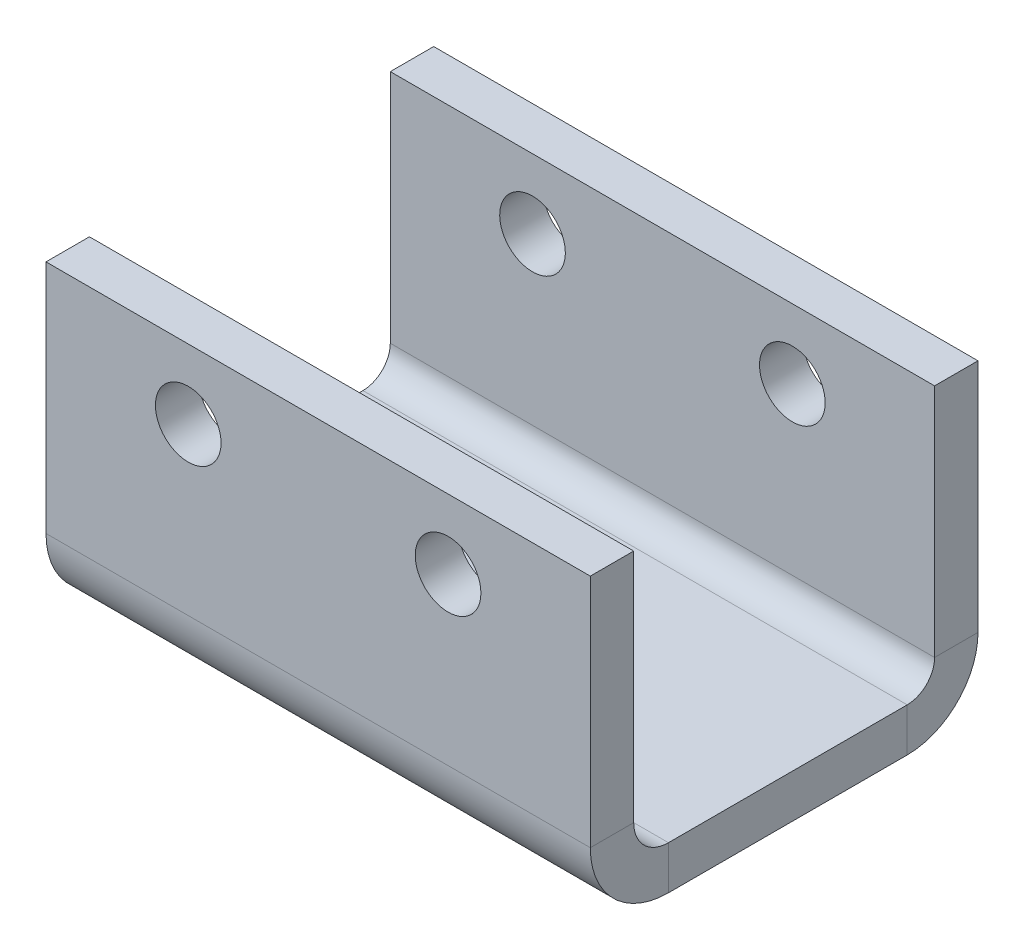
ISO-10303-21;
HEADER;
FILE_DESCRIPTION(('STEP AP214'),'2;1');
FILE_NAME('part.step','',(''),(''),'','','');
FILE_SCHEMA(('AUTOMOTIVE_DESIGN { 1 0 10303 214 1 1 1 1 }'));
ENDSEC;
DATA;
#1=APPLICATION_CONTEXT('core data for automotive mechanical design processes');
#2=APPLICATION_PROTOCOL_DEFINITION('international standard','automotive_design',2000,#1);
#3=PRODUCT_CONTEXT('',#1,'mechanical');
#4=PRODUCT('Part','Part','',(#3));
#5=PRODUCT_RELATED_PRODUCT_CATEGORY('part','',(#4));
#6=PRODUCT_DEFINITION_FORMATION('','',#4);
#7=PRODUCT_DEFINITION_CONTEXT('part definition',#1,'design');
#8=PRODUCT_DEFINITION('design','',#6,#7);
#9=PRODUCT_DEFINITION_SHAPE('','',#8);
#10=(LENGTH_UNIT() NAMED_UNIT(*) SI_UNIT(.MILLI.,.METRE.));
#11=(NAMED_UNIT(*) PLANE_ANGLE_UNIT() SI_UNIT($,.RADIAN.));
#12=(NAMED_UNIT(*) SI_UNIT($,.STERADIAN.) SOLID_ANGLE_UNIT());
#13=UNCERTAINTY_MEASURE_WITH_UNIT(LENGTH_MEASURE(1.E-05),#10,'distance_accuracy_value','');
#14=(GEOMETRIC_REPRESENTATION_CONTEXT(3) GLOBAL_UNCERTAINTY_ASSIGNED_CONTEXT((#13)) GLOBAL_UNIT_ASSIGNED_CONTEXT((#10,
#11,#12)) REPRESENTATION_CONTEXT('',''));
#15=CARTESIAN_POINT('',(0.,0.,0.));
#16=DIRECTION('',(0.,0.,1.));
#17=DIRECTION('',(1.,0.,0.));
#18=AXIS2_PLACEMENT_3D('',#15,#16,#17);
#19=CARTESIAN_POINT('',(9.95,2.54,0.79375));
#20=DIRECTION('',(1.,0.,0.));
#21=DIRECTION('',(0.,1.,0.));
#22=AXIS2_PLACEMENT_3D('',#19,#20,#21);
#23=PLANE('',#22);
#24=DIRECTION('',(0.,0.,1.));
#25=VECTOR('',#24,1.);
#26=CARTESIAN_POINT('',(9.95,-6.06,0.79375));
#27=LINE('',#26,#25);
#28=CARTESIAN_POINT('',(9.95,-6.06,-0.793749999999999));
#29=VERTEX_POINT('',#28);
#30=CARTESIAN_POINT('',(9.95,-6.06,0.79375));
#31=VERTEX_POINT('',#30);
#32=EDGE_CURVE('E13',#29,#31,#27,.T.);
#33=ORIENTED_EDGE('',*,*,#32,.F.);
#34=DIRECTION('',(0.,1.,0.));
#35=VECTOR('',#34,1.);
#36=CARTESIAN_POINT('',(9.95,0.,-0.79375));
#37=LINE('',#36,#35);
#38=CARTESIAN_POINT('',(9.95,2.54,-0.79375));
#39=VERTEX_POINT('',#38);
#40=EDGE_CURVE('E225',#29,#39,#37,.T.);
#41=ORIENTED_EDGE('',*,*,#40,.T.);
#42=DIRECTION('',(0.,0.,1.));
#43=VECTOR('',#42,1.);
#44=CARTESIAN_POINT('',(9.95,2.54,0.79375));
#45=LINE('',#44,#43);
#46=CARTESIAN_POINT('',(9.95,2.54,0.79375));
#47=VERTEX_POINT('',#46);
#48=EDGE_CURVE('E97',#39,#47,#45,.T.);
#49=ORIENTED_EDGE('',*,*,#48,.T.);
#50=DIRECTION('',(0.,1.,0.));
#51=VECTOR('',#50,1.);
#52=CARTESIAN_POINT('',(9.95,2.54,0.79375));
#53=LINE('',#52,#51);
#54=EDGE_CURVE('E209',#31,#47,#53,.T.);
#55=ORIENTED_EDGE('',*,*,#54,.F.);
#56=EDGE_LOOP('',(#33,#41,#49,#55));
#57=FACE_BOUND('',#56,.T.);
#58=ADVANCED_FACE('F87',(#57),#23,.T.);
#59=CARTESIAN_POINT('',(-9.94999999999999,2.54,0.79375));
#60=DIRECTION('',(0.,1.,0.));
#61=DIRECTION('',(-1.,0.,0.));
#62=AXIS2_PLACEMENT_3D('',#59,#60,#61);
#63=PLANE('',#62);
#64=ORIENTED_EDGE('',*,*,#48,.F.);
#65=DIRECTION('',(1.,0.,0.));
#66=VECTOR('',#65,1.);
#67=CARTESIAN_POINT('',(0.,2.54,-0.79375));
#68=LINE('',#67,#66);
#69=CARTESIAN_POINT('',(-9.94999999999999,2.54,-0.79375));
#70=VERTEX_POINT('',#69);
#71=EDGE_CURVE('E223',#39,#70,#68,.F.);
#72=ORIENTED_EDGE('',*,*,#71,.T.);
#73=DIRECTION('',(0.,0.,1.));
#74=VECTOR('',#73,1.);
#75=CARTESIAN_POINT('',(-9.94999999999999,2.54,0.79375));
#76=LINE('',#75,#74);
#77=CARTESIAN_POINT('',(-9.94999999999999,2.54,0.79375));
#78=VERTEX_POINT('',#77);
#79=EDGE_CURVE('E105',#70,#78,#76,.T.);
#80=ORIENTED_EDGE('',*,*,#79,.T.);
#81=DIRECTION('',(-1.,0.,0.));
#82=VECTOR('',#81,1.);
#83=CARTESIAN_POINT('',(-9.94999999999999,2.54,0.79375));
#84=LINE('',#83,#82);
#85=EDGE_CURVE('E212',#47,#78,#84,.T.);
#86=ORIENTED_EDGE('',*,*,#85,.F.);
#87=EDGE_LOOP('',(#64,#72,#80,#86));
#88=FACE_BOUND('',#87,.T.);
#89=ADVANCED_FACE('F239',(#88),#63,.T.);
#90=CARTESIAN_POINT('',(-9.94999999999999,2.54,0.79375));
#91=DIRECTION('',(-1.,0.,0.));
#92=DIRECTION('',(0.,-1.,0.));
#93=AXIS2_PLACEMENT_3D('',#90,#91,#92);
#94=PLANE('',#93);
#95=ORIENTED_EDGE('',*,*,#79,.F.);
#96=DIRECTION('',(0.,1.,0.));
#97=VECTOR('',#96,1.);
#98=CARTESIAN_POINT('',(-9.94999999999999,0.,-0.79375));
#99=LINE('',#98,#97);
#100=CARTESIAN_POINT('',(-9.94999999999999,-6.06,-0.793749999999999));
#101=VERTEX_POINT('',#100);
#102=EDGE_CURVE('E220',#70,#101,#99,.F.);
#103=ORIENTED_EDGE('',*,*,#102,.T.);
#104=DIRECTION('',(0.,0.,1.));
#105=VECTOR('',#104,1.);
#106=CARTESIAN_POINT('',(-9.94999999999999,-6.06,0.79375));
#107=LINE('',#106,#105);
#108=CARTESIAN_POINT('',(-9.94999999999999,-6.06,0.793750000000001));
#109=VERTEX_POINT('',#108);
#110=EDGE_CURVE('E91',#101,#109,#107,.T.);
#111=ORIENTED_EDGE('',*,*,#110,.T.);
#112=DIRECTION('',(0.,-1.,0.));
#113=VECTOR('',#112,1.);
#114=CARTESIAN_POINT('',(-9.94999999999999,2.54,0.79375));
#115=LINE('',#114,#113);
#116=EDGE_CURVE('E204',#78,#109,#115,.T.);
#117=ORIENTED_EDGE('',*,*,#116,.F.);
#118=EDGE_LOOP('',(#95,#103,#111,#117));
#119=FACE_BOUND('',#118,.T.);
#120=ADVANCED_FACE('F241',(#119),#94,.T.);
#121=CARTESIAN_POINT('',(-4.75,0.,0.79375));
#122=DIRECTION('',(0.,0.,1.));
#123=DIRECTION('',(1.,0.,0.));
#124=AXIS2_PLACEMENT_3D('',#121,#122,#123);
#125=CYLINDRICAL_SURFACE('',#124,1.2);
#126=CARTESIAN_POINT('',(-4.75,0.,0.79375));
#127=DIRECTION('',(0.,0.,1.));
#128=DIRECTION('',(1.,0.,0.));
#129=AXIS2_PLACEMENT_3D('',#126,#127,#128);
#130=CIRCLE('',#129,1.2);
#131=CARTESIAN_POINT('',(-3.55,0.,0.79375));
#132=VERTEX_POINT('',#131);
#133=EDGE_CURVE('E201',#132,#132,#130,.T.);
#134=ORIENTED_EDGE('',*,*,#133,.T.);
#135=EDGE_LOOP('',(#134));
#136=FACE_BOUND('',#135,.T.);
#137=CARTESIAN_POINT('',(-4.75,0.,-0.79375));
#138=DIRECTION('',(0.,0.,1.));
#139=DIRECTION('',(1.,0.,0.));
#140=AXIS2_PLACEMENT_3D('',#137,#138,#139);
#141=CIRCLE('',#140,1.2);
#142=CARTESIAN_POINT('',(-3.55,0.,-0.79375));
#143=VERTEX_POINT('',#142);
#144=EDGE_CURVE('E197',#143,#143,#141,.T.);
#145=ORIENTED_EDGE('',*,*,#144,.F.);
#146=EDGE_LOOP('',(#145));
#147=FACE_BOUND('',#146,.T.);
#148=ADVANCED_FACE('F247',(#136,#147),#125,.F.);
#149=CARTESIAN_POINT('',(4.75,0.,0.79375));
#150=DIRECTION('',(0.,0.,1.));
#151=DIRECTION('',(1.,0.,0.));
#152=AXIS2_PLACEMENT_3D('',#149,#150,#151);
#153=CYLINDRICAL_SURFACE('',#152,1.2);
#154=CARTESIAN_POINT('',(4.75,0.,0.79375));
#155=DIRECTION('',(0.,0.,1.));
#156=DIRECTION('',(1.,0.,0.));
#157=AXIS2_PLACEMENT_3D('',#154,#155,#156);
#158=CIRCLE('',#157,1.2);
#159=CARTESIAN_POINT('',(5.95,0.,0.79375));
#160=VERTEX_POINT('',#159);
#161=EDGE_CURVE('E215',#160,#160,#158,.T.);
#162=ORIENTED_EDGE('',*,*,#161,.T.);
#163=EDGE_LOOP('',(#162));
#164=FACE_BOUND('',#163,.T.);
#165=CARTESIAN_POINT('',(4.75,0.,-0.79375));
#166=DIRECTION('',(0.,0.,1.));
#167=DIRECTION('',(1.,0.,0.));
#168=AXIS2_PLACEMENT_3D('',#165,#166,#167);
#169=CIRCLE('',#168,1.2);
#170=CARTESIAN_POINT('',(5.95,0.,-0.79375));
#171=VERTEX_POINT('',#170);
#172=EDGE_CURVE('E205',#171,#171,#169,.T.);
#173=ORIENTED_EDGE('',*,*,#172,.F.);
#174=EDGE_LOOP('',(#173));
#175=FACE_BOUND('',#174,.T.);
#176=ADVANCED_FACE('F89',(#164,#175),#153,.F.);
#177=CARTESIAN_POINT('',(0.,0.,0.79375));
#178=DIRECTION('',(0.,0.,1.));
#179=DIRECTION('',(1.,0.,0.));
#180=AXIS2_PLACEMENT_3D('',#177,#178,#179);
#181=PLANE('',#180);
#182=ORIENTED_EDGE('',*,*,#133,.F.);
#183=EDGE_LOOP('',(#182));
#184=FACE_BOUND('',#183,.T.);
#185=ORIENTED_EDGE('',*,*,#116,.T.);
#186=DIRECTION('',(1.,0.,0.));
#187=VECTOR('',#186,1.);
#188=CARTESIAN_POINT('',(-9.94999999999999,-6.06,0.79375));
#189=LINE('',#188,#187);
#190=EDGE_CURVE('E125',#109,#31,#189,.T.);
#191=ORIENTED_EDGE('',*,*,#190,.T.);
#192=ORIENTED_EDGE('',*,*,#54,.T.);
#193=ORIENTED_EDGE('',*,*,#85,.T.);
#194=EDGE_LOOP('',(#185,#191,#192,#193));
#195=FACE_BOUND('',#194,.T.);
#196=ORIENTED_EDGE('',*,*,#161,.F.);
#197=EDGE_LOOP('',(#196));
#198=FACE_BOUND('',#197,.T.);
#199=ADVANCED_FACE('F237',(#184,#195,#198),#181,.T.);
#200=CARTESIAN_POINT('',(0.,0.,-0.79375));
#201=DIRECTION('',(0.,0.,1.));
#202=DIRECTION('',(1.,0.,0.));
#203=AXIS2_PLACEMENT_3D('',#200,#201,#202);
#204=PLANE('',#203);
#205=ORIENTED_EDGE('',*,*,#144,.T.);
#206=EDGE_LOOP('',(#205));
#207=FACE_BOUND('',#206,.T.);
#208=ORIENTED_EDGE('',*,*,#102,.F.);
#209=ORIENTED_EDGE('',*,*,#71,.F.);
#210=ORIENTED_EDGE('',*,*,#40,.F.);
#211=DIRECTION('',(1.,0.,0.));
#212=VECTOR('',#211,1.);
#213=CARTESIAN_POINT('',(0.,-6.06,-0.79375));
#214=LINE('',#213,#212);
#215=EDGE_CURVE('E222',#101,#29,#214,.T.);
#216=ORIENTED_EDGE('',*,*,#215,.F.);
#217=EDGE_LOOP('',(#208,#209,#210,#216));
#218=FACE_BOUND('',#217,.T.);
#219=ORIENTED_EDGE('',*,*,#172,.T.);
#220=EDGE_LOOP('',(#219));
#221=FACE_BOUND('',#220,.T.);
#222=ADVANCED_FACE('F253',(#207,#218,#221),#204,.F.);
#223=CARTESIAN_POINT('',(9.95,-6.06,-2.06375));
#224=DIRECTION('',(1.,0.,0.));
#225=DIRECTION('',(0.,0.,-1.));
#226=AXIS2_PLACEMENT_3D('',#223,#224,#225);
#227=PLANE('',#226);
#228=DIRECTION('',(0.,1.,0.));
#229=VECTOR('',#228,1.);
#230=CARTESIAN_POINT('',(9.95,-8.9175,-2.06374999999999));
#231=LINE('',#230,#229);
#232=CARTESIAN_POINT('',(9.95,-7.33,-2.06375));
#233=VERTEX_POINT('',#232);
#234=CARTESIAN_POINT('',(9.95,-8.9175,-2.06374999999999));
#235=VERTEX_POINT('',#234);
#236=EDGE_CURVE('E159',#233,#235,#231,.F.);
#237=ORIENTED_EDGE('',*,*,#236,.F.);
#238=CARTESIAN_POINT('',(9.95,-6.06,-2.06375));
#239=DIRECTION('',(-1.,0.,0.));
#240=DIRECTION('',(0.,0.,1.));
#241=AXIS2_PLACEMENT_3D('',#238,#239,#240);
#242=CIRCLE('',#241,1.27);
#243=EDGE_CURVE('E153',#29,#233,#242,.F.);
#244=ORIENTED_EDGE('',*,*,#243,.F.);
#245=ORIENTED_EDGE('',*,*,#32,.T.);
#246=CARTESIAN_POINT('',(9.95,-6.06,-2.06375));
#247=DIRECTION('',(-1.,0.,0.));
#248=DIRECTION('',(0.,0.,1.));
#249=AXIS2_PLACEMENT_3D('',#246,#247,#248);
#250=CIRCLE('',#249,2.8575);
#251=EDGE_CURVE('E194',#31,#235,#250,.F.);
#252=ORIENTED_EDGE('',*,*,#251,.T.);
#253=EDGE_LOOP('',(#237,#244,#245,#252));
#254=FACE_BOUND('',#253,.T.);
#255=ADVANCED_FACE('F256',(#254),#227,.T.);
#256=CARTESIAN_POINT('',(-9.94999999999999,-6.06,-2.06375));
#257=DIRECTION('',(1.,0.,0.));
#258=DIRECTION('',(0.,0.,-1.));
#259=AXIS2_PLACEMENT_3D('',#256,#257,#258);
#260=PLANE('',#259);
#261=CARTESIAN_POINT('',(-9.94999999999999,-6.06,-2.06375));
#262=DIRECTION('',(-1.,0.,0.));
#263=DIRECTION('',(0.,0.,1.));
#264=AXIS2_PLACEMENT_3D('',#261,#262,#263);
#265=CIRCLE('',#264,1.27);
#266=CARTESIAN_POINT('',(-9.94999999999999,-7.33,-2.06375));
#267=VERTEX_POINT('',#266);
#268=EDGE_CURVE('E150',#267,#101,#265,.T.);
#269=ORIENTED_EDGE('',*,*,#268,.F.);
#270=DIRECTION('',(0.,1.,0.));
#271=VECTOR('',#270,1.);
#272=CARTESIAN_POINT('',(-9.94999999999999,-7.33,-2.06375));
#273=LINE('',#272,#271);
#274=CARTESIAN_POINT('',(-9.94999999999999,-8.9175,-2.06374999999999));
#275=VERTEX_POINT('',#274);
#276=EDGE_CURVE('E158',#267,#275,#273,.F.);
#277=ORIENTED_EDGE('',*,*,#276,.T.);
#278=CARTESIAN_POINT('',(-9.94999999999999,-6.06,-2.06375));
#279=DIRECTION('',(-1.,0.,0.));
#280=DIRECTION('',(0.,0.,1.));
#281=AXIS2_PLACEMENT_3D('',#278,#279,#280);
#282=CIRCLE('',#281,2.8575);
#283=EDGE_CURVE('E198',#275,#109,#282,.T.);
#284=ORIENTED_EDGE('',*,*,#283,.T.);
#285=ORIENTED_EDGE('',*,*,#110,.F.);
#286=EDGE_LOOP('',(#269,#277,#284,#285));
#287=FACE_BOUND('',#286,.T.);
#288=ADVANCED_FACE('F164',(#287),#260,.F.);
#289=CARTESIAN_POINT('',(-9.94999999999999,-6.06,-2.06375));
#290=DIRECTION('',(-1.,0.,0.));
#291=DIRECTION('',(0.,-1.,0.));
#292=AXIS2_PLACEMENT_3D('',#289,#290,#291);
#293=CYLINDRICAL_SURFACE('',#292,2.8575);
#294=ORIENTED_EDGE('',*,*,#190,.F.);
#295=ORIENTED_EDGE('',*,*,#283,.F.);
#296=DIRECTION('',(-1.,0.,0.));
#297=VECTOR('',#296,1.);
#298=CARTESIAN_POINT('',(9.95,-8.9175,-2.06374999999999));
#299=LINE('',#298,#297);
#300=EDGE_CURVE('E180',#275,#235,#299,.F.);
#301=ORIENTED_EDGE('',*,*,#300,.T.);
#302=ORIENTED_EDGE('',*,*,#251,.F.);
#303=EDGE_LOOP('',(#294,#295,#301,#302));
#304=FACE_BOUND('',#303,.T.);
#305=ADVANCED_FACE('F263',(#304),#293,.T.);
#306=CARTESIAN_POINT('',(-9.94999999999999,-6.06,-2.06375));
#307=DIRECTION('',(-1.,0.,0.));
#308=DIRECTION('',(0.,-1.,0.));
#309=AXIS2_PLACEMENT_3D('',#306,#307,#308);
#310=CYLINDRICAL_SURFACE('',#309,1.27);
#311=ORIENTED_EDGE('',*,*,#215,.T.);
#312=ORIENTED_EDGE('',*,*,#243,.T.);
#313=DIRECTION('',(-1.,0.,0.));
#314=VECTOR('',#313,1.);
#315=CARTESIAN_POINT('',(9.95,-7.33,-2.06375));
#316=LINE('',#315,#314);
#317=EDGE_CURVE('E147',#233,#267,#316,.T.);
#318=ORIENTED_EDGE('',*,*,#317,.T.);
#319=ORIENTED_EDGE('',*,*,#268,.T.);
#320=EDGE_LOOP('',(#311,#312,#318,#319));
#321=FACE_BOUND('',#320,.T.);
#322=ADVANCED_FACE('F149',(#321),#310,.F.);
#323=CARTESIAN_POINT('',(-9.94999999999998,-8.91750000000003,-10.79375));
#324=DIRECTION('',(1.,0.,0.));
#325=DIRECTION('',(0.,0.,-1.));
#326=AXIS2_PLACEMENT_3D('',#323,#324,#325);
#327=PLANE('',#326);
#328=ORIENTED_EDGE('',*,*,#276,.F.);
#329=DIRECTION('',(0.,0.,1.));
#330=VECTOR('',#329,1.);
#331=CARTESIAN_POINT('',(-9.94999999999998,-7.33000000000003,-10.79375));
#332=LINE('',#331,#330);
#333=CARTESIAN_POINT('',(-9.94999999999998,-7.33000000000004,-10.79375));
#334=VERTEX_POINT('',#333);
#335=EDGE_CURVE('E176',#267,#334,#332,.F.);
#336=ORIENTED_EDGE('',*,*,#335,.T.);
#337=DIRECTION('',(0.,1.,0.));
#338=VECTOR('',#337,1.);
#339=CARTESIAN_POINT('',(-9.94999999999998,-8.91750000000003,-10.79375));
#340=LINE('',#339,#338);
#341=CARTESIAN_POINT('',(-9.94999999999998,-8.91750000000004,-10.79375));
#342=VERTEX_POINT('',#341);
#343=EDGE_CURVE('E168',#342,#334,#340,.T.);
#344=ORIENTED_EDGE('',*,*,#343,.F.);
#345=DIRECTION('',(0.,0.,-1.));
#346=VECTOR('',#345,1.);
#347=CARTESIAN_POINT('',(-9.94999999999999,-8.91749999999999,0.));
#348=LINE('',#347,#346);
#349=EDGE_CURVE('E179',#275,#342,#348,.T.);
#350=ORIENTED_EDGE('',*,*,#349,.F.);
#351=EDGE_LOOP('',(#328,#336,#344,#350));
#352=FACE_BOUND('',#351,.T.);
#353=ADVANCED_FACE('F173',(#352),#327,.F.);
#354=CARTESIAN_POINT('',(9.95,-8.9175,-0.793749999999994));
#355=DIRECTION('',(-1.,0.,0.));
#356=DIRECTION('',(0.,0.,1.));
#357=AXIS2_PLACEMENT_3D('',#354,#355,#356);
#358=PLANE('',#357);
#359=ORIENTED_EDGE('',*,*,#236,.T.);
#360=DIRECTION('',(0.,0.,1.));
#361=VECTOR('',#360,1.);
#362=CARTESIAN_POINT('',(9.95,-8.91749999999999,0.));
#363=LINE('',#362,#361);
#364=CARTESIAN_POINT('',(9.95,-8.91750000000003,-10.79375));
#365=VERTEX_POINT('',#364);
#366=EDGE_CURVE('E369',#365,#235,#363,.T.);
#367=ORIENTED_EDGE('',*,*,#366,.F.);
#368=DIRECTION('',(0.,1.,0.));
#369=VECTOR('',#368,1.);
#370=CARTESIAN_POINT('',(9.95,-8.91750000000003,-10.79375));
#371=LINE('',#370,#369);
#372=CARTESIAN_POINT('',(9.95,-7.33000000000004,-10.79375));
#373=VERTEX_POINT('',#372);
#374=EDGE_CURVE('E366',#365,#373,#371,.T.);
#375=ORIENTED_EDGE('',*,*,#374,.T.);
#376=DIRECTION('',(0.,0.,-1.));
#377=VECTOR('',#376,1.);
#378=CARTESIAN_POINT('',(9.95,-7.33,-0.79375));
#379=LINE('',#378,#377);
#380=EDGE_CURVE('E186',#373,#233,#379,.F.);
#381=ORIENTED_EDGE('',*,*,#380,.T.);
#382=EDGE_LOOP('',(#359,#367,#375,#381));
#383=FACE_BOUND('',#382,.T.);
#384=ADVANCED_FACE('F273',(#383),#358,.F.);
#385=CARTESIAN_POINT('',(0.,-8.91749999999999,0.));
#386=DIRECTION('',(0.,1.,0.));
#387=DIRECTION('',(0.,0.,1.));
#388=AXIS2_PLACEMENT_3D('',#385,#386,#387);
#389=PLANE('',#388);
#390=ORIENTED_EDGE('',*,*,#300,.F.);
#391=ORIENTED_EDGE('',*,*,#349,.T.);
#392=DIRECTION('',(1.,0.,0.));
#393=VECTOR('',#392,1.);
#394=CARTESIAN_POINT('',(0.,-8.91750000000003,-10.79375));
#395=LINE('',#394,#393);
#396=EDGE_CURVE('E372',#342,#365,#395,.T.);
#397=ORIENTED_EDGE('',*,*,#396,.T.);
#398=ORIENTED_EDGE('',*,*,#366,.T.);
#399=EDGE_LOOP('',(#390,#391,#397,#398));
#400=FACE_BOUND('',#399,.T.);
#401=ADVANCED_FACE('F276',(#400),#389,.F.);
#402=CARTESIAN_POINT('',(0.,-7.32999999999999,0.));
#403=DIRECTION('',(0.,1.,0.));
#404=DIRECTION('',(0.,0.,1.));
#405=AXIS2_PLACEMENT_3D('',#402,#403,#404);
#406=PLANE('',#405);
#407=ORIENTED_EDGE('',*,*,#335,.F.);
#408=ORIENTED_EDGE('',*,*,#317,.F.);
#409=ORIENTED_EDGE('',*,*,#380,.F.);
#410=DIRECTION('',(-1.,0.,0.));
#411=VECTOR('',#410,1.);
#412=CARTESIAN_POINT('',(9.95,-7.33000000000003,-10.79375));
#413=LINE('',#412,#411);
#414=EDGE_CURVE('E184',#334,#373,#413,.F.);
#415=ORIENTED_EDGE('',*,*,#414,.F.);
#416=EDGE_LOOP('',(#407,#408,#409,#415));
#417=FACE_BOUND('',#416,.T.);
#418=ADVANCED_FACE('F182',(#417),#406,.T.);
#419=CARTESIAN_POINT('',(9.95,-6.33000000000004,-10.79375));
#420=DIRECTION('',(1.,0.,0.));
#421=DIRECTION('',(0.,0.,-1.));
#422=AXIS2_PLACEMENT_3D('',#419,#420,#421);
#423=PLANE('',#422);
#424=DIRECTION('',(0.,0.,1.));
#425=VECTOR('',#424,1.);
#426=CARTESIAN_POINT('',(9.95,-6.33000000000003,-13.3812500000001));
#427=LINE('',#426,#425);
#428=CARTESIAN_POINT('',(9.95,-6.33000000000005,-11.79375));
#429=VERTEX_POINT('',#428);
#430=CARTESIAN_POINT('',(9.95,-6.33000000000006,-13.38125));
#431=VERTEX_POINT('',#430);
#432=EDGE_CURVE('E349',#429,#431,#427,.F.);
#433=ORIENTED_EDGE('',*,*,#432,.F.);
#434=CARTESIAN_POINT('',(9.95,-6.33000000000004,-10.79375));
#435=DIRECTION('',(-1.,0.,0.));
#436=DIRECTION('',(0.,0.,1.));
#437=AXIS2_PLACEMENT_3D('',#434,#435,#436);
#438=CIRCLE('',#437,1.);
#439=EDGE_CURVE('E357',#373,#429,#438,.F.);
#440=ORIENTED_EDGE('',*,*,#439,.F.);
#441=ORIENTED_EDGE('',*,*,#374,.F.);
#442=CARTESIAN_POINT('',(9.95,-6.33000000000004,-10.79375));
#443=DIRECTION('',(-1.,0.,0.));
#444=DIRECTION('',(0.,0.,1.));
#445=AXIS2_PLACEMENT_3D('',#442,#443,#444);
#446=CIRCLE('',#445,2.5875);
#447=EDGE_CURVE('E193',#365,#431,#446,.F.);
#448=ORIENTED_EDGE('',*,*,#447,.T.);
#449=EDGE_LOOP('',(#433,#440,#441,#448));
#450=FACE_BOUND('',#449,.T.);
#451=ADVANCED_FACE('F280',(#450),#423,.T.);
#452=CARTESIAN_POINT('',(-9.94999999999998,-6.33000000000004,-10.79375));
#453=DIRECTION('',(1.,0.,0.));
#454=DIRECTION('',(0.,0.,-1.));
#455=AXIS2_PLACEMENT_3D('',#452,#453,#454);
#456=PLANE('',#455);
#457=CARTESIAN_POINT('',(-9.94999999999998,-6.33000000000004,-10.79375));
#458=DIRECTION('',(-1.,0.,0.));
#459=DIRECTION('',(0.,0.,1.));
#460=AXIS2_PLACEMENT_3D('',#457,#458,#459);
#461=CIRCLE('',#460,1.);
#462=CARTESIAN_POINT('',(-9.94999999999998,-6.33000000000005,-11.79375));
#463=VERTEX_POINT('',#462);
#464=EDGE_CURVE('E360',#463,#334,#461,.T.);
#465=ORIENTED_EDGE('',*,*,#464,.F.);
#466=DIRECTION('',(0.,0.,1.));
#467=VECTOR('',#466,1.);
#468=CARTESIAN_POINT('',(-9.94999999999998,-6.33000000000004,-11.79375));
#469=LINE('',#468,#467);
#470=CARTESIAN_POINT('',(-9.94999999999998,-6.33000000000002,-13.38125));
#471=VERTEX_POINT('',#470);
#472=EDGE_CURVE('E340',#463,#471,#469,.F.);
#473=ORIENTED_EDGE('',*,*,#472,.T.);
#474=CARTESIAN_POINT('',(-9.94999999999998,-6.33000000000004,-10.79375));
#475=DIRECTION('',(-1.,0.,0.));
#476=DIRECTION('',(0.,0.,1.));
#477=AXIS2_PLACEMENT_3D('',#474,#475,#476);
#478=CIRCLE('',#477,2.5875);
#479=EDGE_CURVE('E354',#471,#342,#478,.T.);
#480=ORIENTED_EDGE('',*,*,#479,.T.);
#481=ORIENTED_EDGE('',*,*,#343,.T.);
#482=EDGE_LOOP('',(#465,#473,#480,#481));
#483=FACE_BOUND('',#482,.T.);
#484=ADVANCED_FACE('F284',(#483),#456,.F.);
#485=CARTESIAN_POINT('',(-9.94999999999998,-6.33000000000004,-10.79375));
#486=DIRECTION('',(-1.,0.,0.));
#487=DIRECTION('',(0.,0.,-1.));
#488=AXIS2_PLACEMENT_3D('',#485,#486,#487);
#489=CYLINDRICAL_SURFACE('',#488,2.5875);
#490=ORIENTED_EDGE('',*,*,#396,.F.);
#491=ORIENTED_EDGE('',*,*,#479,.F.);
#492=DIRECTION('',(-1.,0.,0.));
#493=VECTOR('',#492,1.);
#494=CARTESIAN_POINT('',(0.,-6.33000000000002,-13.38125));
#495=LINE('',#494,#493);
#496=EDGE_CURVE('E335',#431,#471,#495,.T.);
#497=ORIENTED_EDGE('',*,*,#496,.F.);
#498=ORIENTED_EDGE('',*,*,#447,.F.);
#499=EDGE_LOOP('',(#490,#491,#497,#498));
#500=FACE_BOUND('',#499,.T.);
#501=ADVANCED_FACE('F287',(#500),#489,.T.);
#502=CARTESIAN_POINT('',(-9.94999999999998,-6.33000000000004,-10.79375));
#503=DIRECTION('',(-1.,0.,0.));
#504=DIRECTION('',(0.,0.,-1.));
#505=AXIS2_PLACEMENT_3D('',#502,#503,#504);
#506=CYLINDRICAL_SURFACE('',#505,1.);
#507=ORIENTED_EDGE('',*,*,#414,.T.);
#508=ORIENTED_EDGE('',*,*,#439,.T.);
#509=DIRECTION('',(1.,0.,0.));
#510=VECTOR('',#509,1.);
#511=CARTESIAN_POINT('',(9.95,-6.33000000000004,-11.79375));
#512=LINE('',#511,#510);
#513=EDGE_CURVE('E346',#429,#463,#512,.F.);
#514=ORIENTED_EDGE('',*,*,#513,.T.);
#515=ORIENTED_EDGE('',*,*,#464,.T.);
#516=EDGE_LOOP('',(#507,#508,#514,#515));
#517=FACE_BOUND('',#516,.T.);
#518=ADVANCED_FACE('F292',(#517),#506,.F.);
#519=CARTESIAN_POINT('',(0.,0.,-13.38125));
#520=DIRECTION('',(0.,0.,-1.));
#521=DIRECTION('',(0.,1.,0.));
#522=AXIS2_PLACEMENT_3D('',#519,#520,#521);
#523=PLANE('',#522);
#524=CARTESIAN_POINT('',(4.75000000000001,-0.270000000000044,-13.38125));
#525=DIRECTION('',(0.,0.,-1.));
#526=DIRECTION('',(0.,1.,0.));
#527=AXIS2_PLACEMENT_3D('',#524,#525,#526);
#528=CIRCLE('',#527,1.2);
#529=CARTESIAN_POINT('',(4.75000000000001,0.929999999999955,-13.3812500000001));
#530=VERTEX_POINT('',#529);
#531=EDGE_CURVE('E705',#530,#530,#528,.T.);
#532=ORIENTED_EDGE('',*,*,#531,.F.);
#533=EDGE_LOOP('',(#532));
#534=FACE_BOUND('',#533,.T.);
#535=CARTESIAN_POINT('',(-4.74999999999999,-0.270000000000043,-13.38125));
#536=DIRECTION('',(0.,0.,-1.));
#537=DIRECTION('',(0.,1.,0.));
#538=AXIS2_PLACEMENT_3D('',#535,#536,#537);
#539=CIRCLE('',#538,1.2);
#540=CARTESIAN_POINT('',(-4.74999999999999,0.929999999999957,-13.3812500000001));
#541=VERTEX_POINT('',#540);
#542=EDGE_CURVE('E331',#541,#541,#539,.T.);
#543=ORIENTED_EDGE('',*,*,#542,.F.);
#544=EDGE_LOOP('',(#543));
#545=FACE_BOUND('',#544,.T.);
#546=DIRECTION('',(0.,1.,0.));
#547=VECTOR('',#546,1.);
#548=CARTESIAN_POINT('',(9.95,0.,-13.38125));
#549=LINE('',#548,#547);
#550=CARTESIAN_POINT('',(9.95,2.26999999999995,-13.3812500000001));
#551=VERTEX_POINT('',#550);
#552=EDGE_CURVE('E689',#551,#431,#549,.F.);
#553=ORIENTED_EDGE('',*,*,#552,.T.);
#554=ORIENTED_EDGE('',*,*,#496,.T.);
#555=DIRECTION('',(0.,-1.,0.));
#556=VECTOR('',#555,1.);
#557=CARTESIAN_POINT('',(-9.94999999999998,0.,-13.38125));
#558=LINE('',#557,#556);
#559=CARTESIAN_POINT('',(-9.94999999999998,2.26999999999996,-13.3812500000001));
#560=VERTEX_POINT('',#559);
#561=EDGE_CURVE('E686',#471,#560,#558,.F.);
#562=ORIENTED_EDGE('',*,*,#561,.T.);
#563=DIRECTION('',(-1.,0.,0.));
#564=VECTOR('',#563,1.);
#565=CARTESIAN_POINT('',(0.,2.26999999999996,-13.3812500000001));
#566=LINE('',#565,#564);
#567=EDGE_CURVE('E692',#560,#551,#566,.F.);
#568=ORIENTED_EDGE('',*,*,#567,.T.);
#569=EDGE_LOOP('',(#553,#554,#562,#568));
#570=FACE_BOUND('',#569,.T.);
#571=ADVANCED_FACE('F295',(#534,#545,#570),#523,.T.);
#572=CARTESIAN_POINT('',(0.,0.,-11.7937500000001));
#573=DIRECTION('',(0.,0.,-1.));
#574=DIRECTION('',(0.,1.,0.));
#575=AXIS2_PLACEMENT_3D('',#572,#573,#574);
#576=PLANE('',#575);
#577=CARTESIAN_POINT('',(-4.74999999999999,-0.270000000000031,-11.79375));
#578=DIRECTION('',(0.,0.,-1.));
#579=DIRECTION('',(0.,1.,0.));
#580=AXIS2_PLACEMENT_3D('',#577,#578,#579);
#581=CIRCLE('',#580,1.2);
#582=CARTESIAN_POINT('',(-4.74999999999999,0.929999999999968,-11.7937500000001));
#583=VERTEX_POINT('',#582);
#584=EDGE_CURVE('E334',#583,#583,#581,.T.);
#585=ORIENTED_EDGE('',*,*,#584,.T.);
#586=EDGE_LOOP('',(#585));
#587=FACE_BOUND('',#586,.T.);
#588=CARTESIAN_POINT('',(4.75000000000001,-0.270000000000033,-11.79375));
#589=DIRECTION('',(0.,0.,-1.));
#590=DIRECTION('',(0.,1.,0.));
#591=AXIS2_PLACEMENT_3D('',#588,#589,#590);
#592=CIRCLE('',#591,1.2);
#593=CARTESIAN_POINT('',(4.75000000000001,0.929999999999966,-11.7937500000001));
#594=VERTEX_POINT('',#593);
#595=EDGE_CURVE('E337',#594,#594,#592,.T.);
#596=ORIENTED_EDGE('',*,*,#595,.T.);
#597=EDGE_LOOP('',(#596));
#598=FACE_BOUND('',#597,.T.);
#599=ORIENTED_EDGE('',*,*,#513,.F.);
#600=DIRECTION('',(0.,-1.,0.));
#601=VECTOR('',#600,1.);
#602=CARTESIAN_POINT('',(9.95,2.26999999999997,-11.7937500000001));
#603=LINE('',#602,#601);
#604=CARTESIAN_POINT('',(9.95,2.26999999999997,-11.7937500000001));
#605=VERTEX_POINT('',#604);
#606=EDGE_CURVE('E693',#605,#429,#603,.T.);
#607=ORIENTED_EDGE('',*,*,#606,.F.);
#608=DIRECTION('',(1.,0.,0.));
#609=VECTOR('',#608,1.);
#610=CARTESIAN_POINT('',(-9.94999999999998,2.26999999999997,-11.7937500000001));
#611=LINE('',#610,#609);
#612=CARTESIAN_POINT('',(-9.94999999999998,2.26999999999997,-11.7937500000001));
#613=VERTEX_POINT('',#612);
#614=EDGE_CURVE('E697',#613,#605,#611,.T.);
#615=ORIENTED_EDGE('',*,*,#614,.F.);
#616=DIRECTION('',(0.,1.,0.));
#617=VECTOR('',#616,1.);
#618=CARTESIAN_POINT('',(-9.94999999999998,-7.33000000000003,-11.79375));
#619=LINE('',#618,#617);
#620=EDGE_CURVE('E703',#463,#613,#619,.T.);
#621=ORIENTED_EDGE('',*,*,#620,.F.);
#622=EDGE_LOOP('',(#599,#607,#615,#621));
#623=FACE_BOUND('',#622,.T.);
#624=ADVANCED_FACE('F304',(#587,#598,#623),#576,.F.);
#625=CARTESIAN_POINT('',(-9.94999999999998,-7.33000000000004,-13.38125));
#626=DIRECTION('',(1.,0.,0.));
#627=DIRECTION('',(0.,0.,-1.));
#628=AXIS2_PLACEMENT_3D('',#625,#626,#627);
#629=PLANE('',#628);
#630=ORIENTED_EDGE('',*,*,#472,.F.);
#631=ORIENTED_EDGE('',*,*,#620,.T.);
#632=DIRECTION('',(0.,0.,1.));
#633=VECTOR('',#632,1.);
#634=CARTESIAN_POINT('',(-9.94999999999998,2.26999999999996,-13.3812500000001));
#635=LINE('',#634,#633);
#636=EDGE_CURVE('E363',#560,#613,#635,.T.);
#637=ORIENTED_EDGE('',*,*,#636,.F.);
#638=ORIENTED_EDGE('',*,*,#561,.F.);
#639=EDGE_LOOP('',(#630,#631,#637,#638));
#640=FACE_BOUND('',#639,.T.);
#641=ADVANCED_FACE('F300',(#640),#629,.F.);
#642=CARTESIAN_POINT('',(9.95,2.26999999999995,-13.3812500000001));
#643=DIRECTION('',(-1.,0.,0.));
#644=DIRECTION('',(0.,0.,1.));
#645=AXIS2_PLACEMENT_3D('',#642,#643,#644);
#646=PLANE('',#645);
#647=ORIENTED_EDGE('',*,*,#432,.T.);
#648=ORIENTED_EDGE('',*,*,#552,.F.);
#649=DIRECTION('',(0.,0.,1.));
#650=VECTOR('',#649,1.);
#651=CARTESIAN_POINT('',(9.95,2.26999999999995,-13.3812500000001));
#652=LINE('',#651,#650);
#653=EDGE_CURVE('E718',#551,#605,#652,.T.);
#654=ORIENTED_EDGE('',*,*,#653,.T.);
#655=ORIENTED_EDGE('',*,*,#606,.T.);
#656=EDGE_LOOP('',(#647,#648,#654,#655));
#657=FACE_BOUND('',#656,.T.);
#658=ADVANCED_FACE('F303',(#657),#646,.F.);
#659=CARTESIAN_POINT('',(-9.94999999999998,2.26999999999996,-13.3812500000001));
#660=DIRECTION('',(0.,-1.,0.));
#661=DIRECTION('',(0.,0.,-1.));
#662=AXIS2_PLACEMENT_3D('',#659,#660,#661);
#663=PLANE('',#662);
#664=ORIENTED_EDGE('',*,*,#614,.T.);
#665=ORIENTED_EDGE('',*,*,#653,.F.);
#666=ORIENTED_EDGE('',*,*,#567,.F.);
#667=ORIENTED_EDGE('',*,*,#636,.T.);
#668=EDGE_LOOP('',(#664,#665,#666,#667));
#669=FACE_BOUND('',#668,.T.);
#670=ADVANCED_FACE('F306',(#669),#663,.F.);
#671=CARTESIAN_POINT('',(4.75000000000001,-0.270000000000044,-13.38125));
#672=DIRECTION('',(0.,0.,1.));
#673=DIRECTION('',(0.,-1.,0.));
#674=AXIS2_PLACEMENT_3D('',#671,#672,#673);
#675=CYLINDRICAL_SURFACE('',#674,1.2);
#676=ORIENTED_EDGE('',*,*,#531,.T.);
#677=EDGE_LOOP('',(#676));
#678=FACE_BOUND('',#677,.T.);
#679=ORIENTED_EDGE('',*,*,#595,.F.);
#680=EDGE_LOOP('',(#679));
#681=FACE_BOUND('',#680,.T.);
#682=ADVANCED_FACE('F309',(#678,#681),#675,.F.);
#683=CARTESIAN_POINT('',(-4.74999999999999,-0.270000000000043,-13.38125));
#684=DIRECTION('',(0.,0.,1.));
#685=DIRECTION('',(0.,-1.,0.));
#686=AXIS2_PLACEMENT_3D('',#683,#684,#685);
#687=CYLINDRICAL_SURFACE('',#686,1.2);
#688=ORIENTED_EDGE('',*,*,#542,.T.);
#689=EDGE_LOOP('',(#688));
#690=FACE_BOUND('',#689,.T.);
#691=ORIENTED_EDGE('',*,*,#584,.F.);
#692=EDGE_LOOP('',(#691));
#693=FACE_BOUND('',#692,.T.);
#694=ADVANCED_FACE('F322',(#690,#693),#687,.F.);
#695=CLOSED_SHELL('',(#58,#89,#120,#148,#176,#199,#222,#255,#288,#305,#322,#353,#384,#401,#418,
#451,#484,#501,#518,#571,#624,#641,#658,#670,#682,#694));
#696=MANIFOLD_SOLID_BREP('B2',#695);
#697=ADVANCED_BREP_SHAPE_REPRESENTATION('',(#18,#696),#14);
#698=SHAPE_DEFINITION_REPRESENTATION(#9,#697);
ENDSEC;
END-ISO-10303-21;
